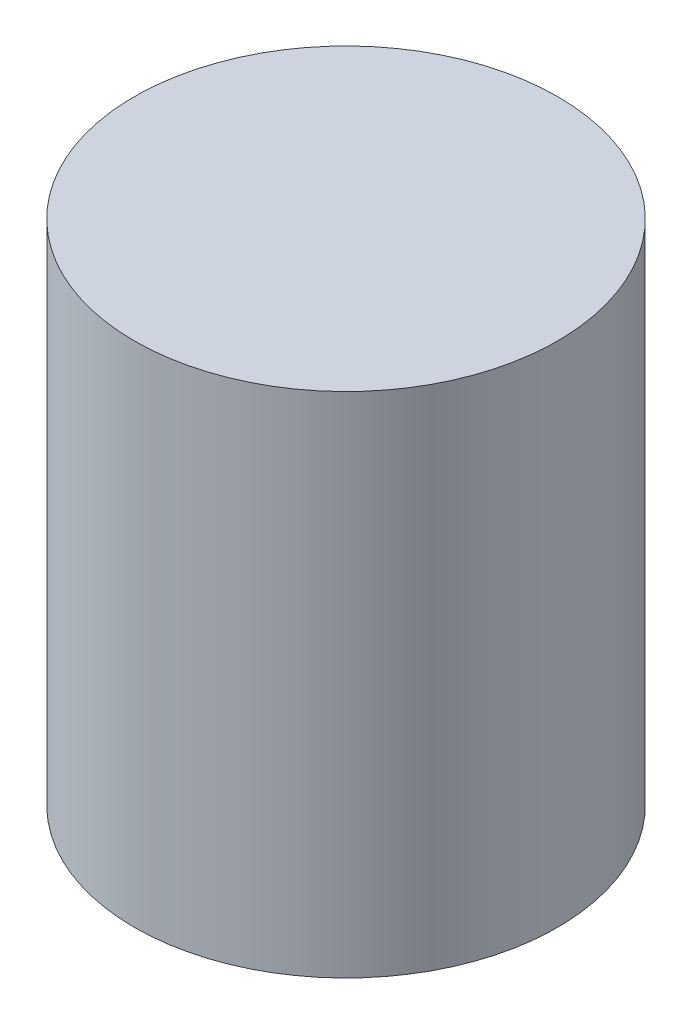
ISO-10303-21;
HEADER;
FILE_DESCRIPTION(('STEP AP214'),'2;1');
FILE_NAME('part.step','',(''),(''),'','','');
FILE_SCHEMA(('AUTOMOTIVE_DESIGN { 1 0 10303 214 1 1 1 1 }'));
ENDSEC;
DATA;
#1=APPLICATION_CONTEXT('core data for automotive mechanical design processes');
#2=APPLICATION_PROTOCOL_DEFINITION('international standard','automotive_design',2000,#1);
#3=PRODUCT_CONTEXT('',#1,'mechanical');
#4=PRODUCT('Part','Part','',(#3));
#5=PRODUCT_RELATED_PRODUCT_CATEGORY('part','',(#4));
#6=PRODUCT_DEFINITION_FORMATION('','',#4);
#7=PRODUCT_DEFINITION_CONTEXT('part definition',#1,'design');
#8=PRODUCT_DEFINITION('design','',#6,#7);
#9=PRODUCT_DEFINITION_SHAPE('','',#8);
#10=(LENGTH_UNIT() NAMED_UNIT(*) SI_UNIT(.MILLI.,.METRE.));
#11=(NAMED_UNIT(*) PLANE_ANGLE_UNIT() SI_UNIT($,.RADIAN.));
#12=(NAMED_UNIT(*) SI_UNIT($,.STERADIAN.) SOLID_ANGLE_UNIT());
#13=UNCERTAINTY_MEASURE_WITH_UNIT(LENGTH_MEASURE(1.E-05),#10,'distance_accuracy_value','');
#14=(GEOMETRIC_REPRESENTATION_CONTEXT(3) GLOBAL_UNCERTAINTY_ASSIGNED_CONTEXT((#13)) GLOBAL_UNIT_ASSIGNED_CONTEXT((#10,
#11,#12)) REPRESENTATION_CONTEXT('',''));
#15=CARTESIAN_POINT('',(0.,0.,0.));
#16=DIRECTION('',(0.,0.,1.));
#17=DIRECTION('',(1.,0.,0.));
#18=AXIS2_PLACEMENT_3D('',#15,#16,#17);
#19=CARTESIAN_POINT('',(0.,1.524,0.));
#20=DIRECTION('',(0.,-1.,0.));
#21=DIRECTION('',(0.,0.,-1.));
#22=AXIS2_PLACEMENT_3D('',#19,#20,#21);
#23=CYLINDRICAL_SURFACE('',#22,0.635);
#24=CARTESIAN_POINT('',(0.,1.524,0.));
#25=DIRECTION('',(0.,1.,0.));
#26=DIRECTION('',(0.,0.,1.));
#27=AXIS2_PLACEMENT_3D('',#24,#25,#26);
#28=CIRCLE('',#27,0.635);
#29=CARTESIAN_POINT('',(0.,1.524,0.635));
#30=VERTEX_POINT('',#29);
#31=EDGE_CURVE('E10',#30,#30,#28,.T.);
#32=ORIENTED_EDGE('',*,*,#31,.F.);
#33=EDGE_LOOP('',(#32));
#34=FACE_BOUND('',#33,.T.);
#35=CARTESIAN_POINT('',(0.,0.,0.));
#36=DIRECTION('',(0.,1.,0.));
#37=DIRECTION('',(0.,0.,1.));
#38=AXIS2_PLACEMENT_3D('',#35,#36,#37);
#39=CIRCLE('',#38,0.635);
#40=CARTESIAN_POINT('',(0.,0.,0.635));
#41=VERTEX_POINT('',#40);
#42=EDGE_CURVE('E42',#41,#41,#39,.T.);
#43=ORIENTED_EDGE('',*,*,#42,.T.);
#44=EDGE_LOOP('',(#43));
#45=FACE_BOUND('',#44,.T.);
#46=ADVANCED_FACE('F39',(#34,#45),#23,.T.);
#47=CARTESIAN_POINT('',(0.,1.524,0.));
#48=DIRECTION('',(0.,1.,0.));
#49=DIRECTION('',(0.,0.,1.));
#50=AXIS2_PLACEMENT_3D('',#47,#48,#49);
#51=PLANE('',#50);
#52=ORIENTED_EDGE('',*,*,#31,.T.);
#53=EDGE_LOOP('',(#52));
#54=FACE_BOUND('',#53,.T.);
#55=ADVANCED_FACE('F56',(#54),#51,.T.);
#56=CARTESIAN_POINT('',(0.,0.,0.));
#57=DIRECTION('',(0.,1.,0.));
#58=DIRECTION('',(0.,0.,1.));
#59=AXIS2_PLACEMENT_3D('',#56,#57,#58);
#60=PLANE('',#59);
#61=ORIENTED_EDGE('',*,*,#42,.F.);
#62=EDGE_LOOP('',(#61));
#63=FACE_BOUND('',#62,.T.);
#64=ADVANCED_FACE('F54',(#63),#60,.F.);
#65=CLOSED_SHELL('',(#46,#55,#64));
#66=MANIFOLD_SOLID_BREP('B2',#65);
#67=ADVANCED_BREP_SHAPE_REPRESENTATION('',(#18,#66),#14);
#68=SHAPE_DEFINITION_REPRESENTATION(#9,#67);
ENDSEC;
END-ISO-10303-21;
